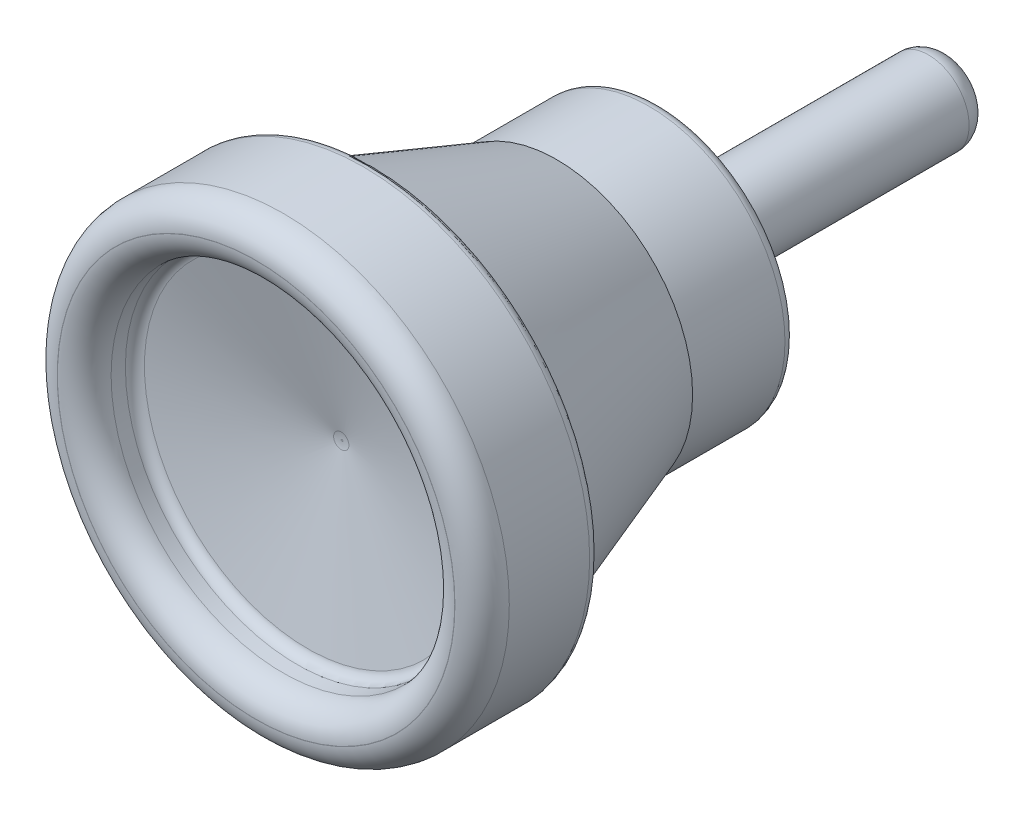
ISO-10303-21;
HEADER;
FILE_DESCRIPTION(('STEP AP214'),'2;1');
FILE_NAME('part.step','',(''),(''),'','','');
FILE_SCHEMA(('AUTOMOTIVE_DESIGN { 1 0 10303 214 1 1 1 1 }'));
ENDSEC;
DATA;
#1=APPLICATION_CONTEXT('core data for automotive mechanical design processes');
#2=APPLICATION_PROTOCOL_DEFINITION('international standard','automotive_design',2000,#1);
#3=PRODUCT_CONTEXT('',#1,'mechanical');
#4=PRODUCT('Part','Part','',(#3));
#5=PRODUCT_RELATED_PRODUCT_CATEGORY('part','',(#4));
#6=PRODUCT_DEFINITION_FORMATION('','',#4);
#7=PRODUCT_DEFINITION_CONTEXT('part definition',#1,'design');
#8=PRODUCT_DEFINITION('design','',#6,#7);
#9=PRODUCT_DEFINITION_SHAPE('','',#8);
#10=(LENGTH_UNIT() NAMED_UNIT(*) SI_UNIT(.MILLI.,.METRE.));
#11=(NAMED_UNIT(*) PLANE_ANGLE_UNIT() SI_UNIT($,.RADIAN.));
#12=(NAMED_UNIT(*) SI_UNIT($,.STERADIAN.) SOLID_ANGLE_UNIT());
#13=UNCERTAINTY_MEASURE_WITH_UNIT(LENGTH_MEASURE(1.E-05),#10,'distance_accuracy_value','');
#14=(GEOMETRIC_REPRESENTATION_CONTEXT(3) GLOBAL_UNCERTAINTY_ASSIGNED_CONTEXT((#13)) GLOBAL_UNIT_ASSIGNED_CONTEXT((#10,
#11,#12)) REPRESENTATION_CONTEXT('',''));
#15=CARTESIAN_POINT('',(0.,0.,0.));
#16=DIRECTION('',(0.,0.,1.));
#17=DIRECTION('',(1.,0.,0.));
#18=AXIS2_PLACEMENT_3D('',#15,#16,#17);
#19=CARTESIAN_POINT('',(0.,0.,-18.3));
#20=DIRECTION('',(0.,0.,1.));
#21=DIRECTION('',(1.,0.,0.));
#22=AXIS2_PLACEMENT_3D('',#19,#20,#21);
#23=TOROIDAL_SURFACE('',#22,5.825,0.5);
#24=CARTESIAN_POINT('',(0.,0.,-18.8));
#25=DIRECTION('',(0.,0.,1.));
#26=DIRECTION('',(1.,0.,0.));
#27=AXIS2_PLACEMENT_3D('',#24,#25,#26);
#28=CIRCLE('',#27,5.825);
#29=CARTESIAN_POINT('',(5.825,0.,-18.8));
#30=VERTEX_POINT('',#29);
#31=EDGE_CURVE('E86',#30,#30,#28,.T.);
#32=ORIENTED_EDGE('',*,*,#31,.T.);
#33=EDGE_LOOP('',(#32));
#34=FACE_BOUND('',#33,.T.);
#35=CARTESIAN_POINT('',(0.,0.,-18.3));
#36=DIRECTION('',(0.,0.,1.));
#37=DIRECTION('',(1.,0.,0.));
#38=AXIS2_PLACEMENT_3D('',#35,#36,#37);
#39=CIRCLE('',#38,6.325);
#40=CARTESIAN_POINT('',(6.325,0.,-18.3));
#41=VERTEX_POINT('',#40);
#42=EDGE_CURVE('E41',#41,#41,#39,.T.);
#43=ORIENTED_EDGE('',*,*,#42,.F.);
#44=EDGE_LOOP('',(#43));
#45=FACE_BOUND('',#44,.T.);
#46=ADVANCED_FACE('F30',(#34,#45),#23,.T.);
#47=CARTESIAN_POINT('',(0.,0.,-4.));
#48=DIRECTION('',(0.,0.,1.));
#49=DIRECTION('',(1.,0.,0.));
#50=AXIS2_PLACEMENT_3D('',#47,#48,#49);
#51=CYLINDRICAL_SURFACE('',#50,6.325);
#52=ORIENTED_EDGE('',*,*,#42,.T.);
#53=EDGE_LOOP('',(#52));
#54=FACE_BOUND('',#53,.T.);
#55=CARTESIAN_POINT('',(0.,0.,-14.));
#56=DIRECTION('',(0.,0.,1.));
#57=DIRECTION('',(1.,0.,0.));
#58=AXIS2_PLACEMENT_3D('',#55,#56,#57);
#59=CIRCLE('',#58,6.325);
#60=CARTESIAN_POINT('',(6.325,0.,-14.));
#61=VERTEX_POINT('',#60);
#62=EDGE_CURVE('E45',#61,#61,#59,.T.);
#63=ORIENTED_EDGE('',*,*,#62,.F.);
#64=EDGE_LOOP('',(#63));
#65=FACE_BOUND('',#64,.T.);
#66=ADVANCED_FACE('F104',(#54,#65),#51,.T.);
#67=CARTESIAN_POINT('',(0.,0.,-6.24797341657317));
#68=DIRECTION('',(0.,0.,1.));
#69=DIRECTION('',(1.,0.,0.));
#70=AXIS2_PLACEMENT_3D('',#67,#68,#69);
#71=CONICAL_SURFACE('',#70,9.07682280357459,0.341105400866473);
#72=ORIENTED_EDGE('',*,*,#62,.T.);
#73=EDGE_LOOP('',(#72));
#74=FACE_BOUND('',#73,.T.);
#75=CARTESIAN_POINT('',(0.,0.,-6.24797341657317));
#76=DIRECTION('',(0.,0.,1.));
#77=DIRECTION('',(1.,0.,0.));
#78=AXIS2_PLACEMENT_3D('',#75,#76,#77);
#79=CIRCLE('',#78,9.07682280357459);
#80=CARTESIAN_POINT('',(9.07682280357459,0.,-6.24797341657317));
#81=VERTEX_POINT('',#80);
#82=EDGE_CURVE('E50',#81,#81,#79,.T.);
#83=ORIENTED_EDGE('',*,*,#82,.F.);
#84=EDGE_LOOP('',(#83));
#85=FACE_BOUND('',#84,.T.);
#86=ADVANCED_FACE('F109',(#74,#85),#71,.T.);
#87=CARTESIAN_POINT('',(0.,0.,-6.41523792157666));
#88=DIRECTION('',(0.,0.,1.));
#89=DIRECTION('',(1.,0.,0.));
#90=AXIS2_PLACEMENT_3D('',#87,#88,#89);
#91=TOROIDAL_SURFACE('',#90,9.54801552992543,0.5);
#92=ORIENTED_EDGE('',*,*,#82,.T.);
#93=EDGE_LOOP('',(#92));
#94=FACE_BOUND('',#93,.T.);
#95=CARTESIAN_POINT('',(0.,0.,-5.97823372066855));
#96=DIRECTION('',(0.,0.,1.));
#97=DIRECTION('',(1.,0.,0.));
#98=AXIS2_PLACEMENT_3D('',#95,#96,#97);
#99=CIRCLE('',#98,9.30506012581046);
#100=CARTESIAN_POINT('',(9.30506012581046,0.,-5.97823372066855));
#101=VERTEX_POINT('',#100);
#102=EDGE_CURVE('E53',#101,#101,#99,.T.);
#103=ORIENTED_EDGE('',*,*,#102,.F.);
#104=EDGE_LOOP('',(#103));
#105=FACE_BOUND('',#104,.T.);
#106=ADVANCED_FACE('F115',(#94,#105),#91,.F.);
#107=CARTESIAN_POINT('',(0.,0.,-5.44290565980612));
#108=DIRECTION('',(0.,0.,1.));
#109=DIRECTION('',(1.,0.,0.));
#110=AXIS2_PLACEMENT_3D('',#107,#108,#109);
#111=CONICAL_SURFACE('',#110,10.267955404115,1.06339135597023);
#112=ORIENTED_EDGE('',*,*,#102,.T.);
#113=EDGE_LOOP('',(#112));
#114=FACE_BOUND('',#113,.T.);
#115=CARTESIAN_POINT('',(0.,0.,-5.44290565980612));
#116=DIRECTION('',(0.,0.,1.));
#117=DIRECTION('',(1.,0.,0.));
#118=AXIS2_PLACEMENT_3D('',#115,#116,#117);
#119=CIRCLE('',#118,10.267955404115);
#120=CARTESIAN_POINT('',(10.267955404115,0.,-5.44290565980612));
#121=VERTEX_POINT('',#120);
#122=EDGE_CURVE('E56',#121,#121,#119,.T.);
#123=ORIENTED_EDGE('',*,*,#122,.F.);
#124=EDGE_LOOP('',(#123));
#125=FACE_BOUND('',#124,.T.);
#126=ADVANCED_FACE('F121',(#114,#125),#111,.T.);
#127=CARTESIAN_POINT('',(0.,0.,-5.00590145889801));
#128=DIRECTION('',(0.,0.,1.));
#129=DIRECTION('',(1.,0.,0.));
#130=AXIS2_PLACEMENT_3D('',#127,#128,#129);
#131=TOROIDAL_SURFACE('',#130,10.025,0.5);
#132=ORIENTED_EDGE('',*,*,#122,.T.);
#133=EDGE_LOOP('',(#132));
#134=FACE_BOUND('',#133,.T.);
#135=CARTESIAN_POINT('',(0.,0.,-5.00590145889801));
#136=DIRECTION('',(0.,0.,1.));
#137=DIRECTION('',(1.,0.,0.));
#138=AXIS2_PLACEMENT_3D('',#135,#136,#137);
#139=CIRCLE('',#138,10.525);
#140=CARTESIAN_POINT('',(10.525,0.,-5.00590145889801));
#141=VERTEX_POINT('',#140);
#142=EDGE_CURVE('E59',#141,#141,#139,.T.);
#143=ORIENTED_EDGE('',*,*,#142,.F.);
#144=EDGE_LOOP('',(#143));
#145=FACE_BOUND('',#144,.T.);
#146=ADVANCED_FACE('F127',(#134,#145),#131,.T.);
#147=CARTESIAN_POINT('',(0.,0.,-4.));
#148=DIRECTION('',(0.,0.,1.));
#149=DIRECTION('',(1.,0.,0.));
#150=AXIS2_PLACEMENT_3D('',#147,#148,#149);
#151=CYLINDRICAL_SURFACE('',#150,10.525);
#152=ORIENTED_EDGE('',*,*,#142,.T.);
#153=EDGE_LOOP('',(#152));
#154=FACE_BOUND('',#153,.T.);
#155=CARTESIAN_POINT('',(0.,0.,-1.26500000000001));
#156=DIRECTION('',(0.,0.,1.));
#157=DIRECTION('',(1.,0.,0.));
#158=AXIS2_PLACEMENT_3D('',#155,#156,#157);
#159=CIRCLE('',#158,10.525);
#160=CARTESIAN_POINT('',(10.525,0.,-1.26500000000001));
#161=VERTEX_POINT('',#160);
#162=EDGE_CURVE('E62',#161,#161,#159,.T.);
#163=ORIENTED_EDGE('',*,*,#162,.F.);
#164=EDGE_LOOP('',(#163));
#165=FACE_BOUND('',#164,.T.);
#166=ADVANCED_FACE('F133',(#154,#165),#151,.T.);
#167=CARTESIAN_POINT('',(0.,0.,-1.265));
#168=DIRECTION('',(0.,0.,1.));
#169=DIRECTION('',(1.,0.,0.));
#170=AXIS2_PLACEMENT_3D('',#167,#168,#169);
#171=TOROIDAL_SURFACE('',#170,9.26,1.265);
#172=ORIENTED_EDGE('',*,*,#162,.T.);
#173=EDGE_LOOP('',(#172));
#174=FACE_BOUND('',#173,.T.);
#175=CARTESIAN_POINT('',(0.,0.,0.));
#176=DIRECTION('',(0.,0.,1.));
#177=DIRECTION('',(1.,0.,0.));
#178=AXIS2_PLACEMENT_3D('',#175,#176,#177);
#179=CIRCLE('',#178,9.25999999999999);
#180=CARTESIAN_POINT('',(9.25999999999999,0.,0.));
#181=VERTEX_POINT('',#180);
#182=EDGE_CURVE('E65',#181,#181,#179,.T.);
#183=ORIENTED_EDGE('',*,*,#182,.F.);
#184=EDGE_LOOP('',(#183));
#185=FACE_BOUND('',#184,.T.);
#186=ADVANCED_FACE('F139',(#174,#185),#171,.T.);
#187=CARTESIAN_POINT('',(9.25000000000001,0.,0.));
#188=DIRECTION('',(0.,0.,1.));
#189=DIRECTION('',(1.,0.,0.));
#190=AXIS2_PLACEMENT_3D('',#187,#188,#189);
#191=PLANE('',#190);
#192=ORIENTED_EDGE('',*,*,#182,.T.);
#193=EDGE_LOOP('',(#192));
#194=FACE_BOUND('',#193,.T.);
#195=CARTESIAN_POINT('',(0.,0.,0.));
#196=DIRECTION('',(0.,0.,1.));
#197=DIRECTION('',(1.,0.,0.));
#198=AXIS2_PLACEMENT_3D('',#195,#196,#197);
#199=CIRCLE('',#198,9.25);
#200=CARTESIAN_POINT('',(9.25,0.,0.));
#201=VERTEX_POINT('',#200);
#202=EDGE_CURVE('E68',#201,#201,#199,.T.);
#203=ORIENTED_EDGE('',*,*,#202,.F.);
#204=EDGE_LOOP('',(#203));
#205=FACE_BOUND('',#204,.T.);
#206=ADVANCED_FACE('F145',(#194,#205),#191,.T.);
#207=CARTESIAN_POINT('',(0.,0.,-1.25));
#208=DIRECTION('',(0.,0.,1.));
#209=DIRECTION('',(1.,0.,0.));
#210=AXIS2_PLACEMENT_3D('',#207,#208,#209);
#211=TOROIDAL_SURFACE('',#210,9.25,1.25);
#212=ORIENTED_EDGE('',*,*,#202,.T.);
#213=EDGE_LOOP('',(#212));
#214=FACE_BOUND('',#213,.T.);
#215=CARTESIAN_POINT('',(0.,0.,-1.25000000000001));
#216=DIRECTION('',(0.,0.,1.));
#217=DIRECTION('',(1.,0.,0.));
#218=AXIS2_PLACEMENT_3D('',#215,#216,#217);
#219=CIRCLE('',#218,8.);
#220=CARTESIAN_POINT('',(8.,0.,-1.25000000000001));
#221=VERTEX_POINT('',#220);
#222=EDGE_CURVE('E71',#221,#221,#219,.T.);
#223=ORIENTED_EDGE('',*,*,#222,.F.);
#224=EDGE_LOOP('',(#223));
#225=FACE_BOUND('',#224,.T.);
#226=ADVANCED_FACE('F151',(#214,#225),#211,.T.);
#227=CARTESIAN_POINT('',(0.,0.,-4.));
#228=DIRECTION('',(0.,0.,1.));
#229=DIRECTION('',(1.,0.,0.));
#230=AXIS2_PLACEMENT_3D('',#227,#228,#229);
#231=CYLINDRICAL_SURFACE('',#230,8.);
#232=ORIENTED_EDGE('',*,*,#222,.T.);
#233=EDGE_LOOP('',(#232));
#234=FACE_BOUND('',#233,.T.);
#235=CARTESIAN_POINT('',(0.,0.,-1.91409394209894));
#236=DIRECTION('',(0.,0.,1.));
#237=DIRECTION('',(1.,0.,0.));
#238=AXIS2_PLACEMENT_3D('',#235,#236,#237);
#239=CIRCLE('',#238,8.);
#240=CARTESIAN_POINT('',(8.,0.,-1.91409394209894));
#241=VERTEX_POINT('',#240);
#242=EDGE_CURVE('E74',#241,#241,#239,.T.);
#243=ORIENTED_EDGE('',*,*,#242,.F.);
#244=EDGE_LOOP('',(#243));
#245=FACE_BOUND('',#244,.T.);
#246=ADVANCED_FACE('F157',(#234,#245),#231,.F.);
#247=CARTESIAN_POINT('',(0.,0.,-1.91409394209894));
#248=DIRECTION('',(0.,0.,1.));
#249=DIRECTION('',(1.,0.,0.));
#250=AXIS2_PLACEMENT_3D('',#247,#248,#249);
#251=TOROIDAL_SURFACE('',#250,7.5,0.5);
#252=ORIENTED_EDGE('',*,*,#242,.T.);
#253=EDGE_LOOP('',(#252));
#254=FACE_BOUND('',#253,.T.);
#255=CARTESIAN_POINT('',(0.,0.,-2.40342069039993));
#256=DIRECTION('',(0.,0.,1.));
#257=DIRECTION('',(1.,0.,0.));
#258=AXIS2_PLACEMENT_3D('',#255,#256,#257);
#259=CIRCLE('',#258,7.6027586171432);
#260=CARTESIAN_POINT('',(7.6027586171432,0.,-2.40342069039993));
#261=VERTEX_POINT('',#260);
#262=EDGE_CURVE('E77',#261,#261,#259,.T.);
#263=ORIENTED_EDGE('',*,*,#262,.F.);
#264=EDGE_LOOP('',(#263));
#265=FACE_BOUND('',#264,.T.);
#266=ADVANCED_FACE('F163',(#254,#265),#251,.F.);
#267=CARTESIAN_POINT('',(0.,0.,-3.9662854081327));
#268=DIRECTION('',(0.,0.,1.));
#269=DIRECTION('',(1.,0.,0.));
#270=AXIS2_PLACEMENT_3D('',#267,#268,#269);
#271=CONICAL_SURFACE('',#270,0.356322322335259,1.35837645501249);
#272=ORIENTED_EDGE('',*,*,#262,.T.);
#273=EDGE_LOOP('',(#272));
#274=FACE_BOUND('',#273,.T.);
#275=CARTESIAN_POINT('',(0.,0.,-3.9662854081327));
#276=DIRECTION('',(0.,0.,1.));
#277=DIRECTION('',(1.,0.,0.));
#278=AXIS2_PLACEMENT_3D('',#275,#276,#277);
#279=CIRCLE('',#278,0.356322322335259);
#280=CARTESIAN_POINT('',(0.356322322335259,0.,-3.9662854081327));
#281=VERTEX_POINT('',#280);
#282=EDGE_CURVE('E80',#281,#281,#279,.T.);
#283=ORIENTED_EDGE('',*,*,#282,.F.);
#284=EDGE_LOOP('',(#283));
#285=FACE_BOUND('',#284,.T.);
#286=ADVANCED_FACE('F169',(#274,#285),#271,.F.);
#287=CARTESIAN_POINT('',(0.,0.,-2.5));
#288=DIRECTION('',(0.,0.,1.));
#289=DIRECTION('',(1.,0.,0.));
#290=AXIS2_PLACEMENT_3D('',#287,#288,#289);
#291=DEGENERATE_TOROIDAL_SURFACE('',#290,0.0400833274324869,1.5,.T.);
#292=ORIENTED_EDGE('',*,*,#282,.T.);
#293=EDGE_LOOP('',(#292));
#294=FACE_BOUND('',#293,.T.);
#295=CARTESIAN_POINT('',(0.,0.,-4.));
#296=DIRECTION('',(0.,0.,1.));
#297=DIRECTION('',(1.,0.,0.));
#298=AXIS2_PLACEMENT_3D('',#295,#296,#297);
#299=CIRCLE('',#298,0.0400833274324806);
#300=CARTESIAN_POINT('',(0.0400833274324806,0.,-4.));
#301=VERTEX_POINT('',#300);
#302=EDGE_CURVE('E83',#301,#301,#299,.T.);
#303=ORIENTED_EDGE('',*,*,#302,.F.);
#304=EDGE_LOOP('',(#303));
#305=FACE_BOUND('',#304,.T.);
#306=ADVANCED_FACE('F175',(#294,#305),#291,.F.);
#307=CARTESIAN_POINT('',(0.,0.,-4.));
#308=DIRECTION('',(0.,0.,1.));
#309=DIRECTION('',(1.,0.,0.));
#310=AXIS2_PLACEMENT_3D('',#307,#308,#309);
#311=PLANE('',#310);
#312=ORIENTED_EDGE('',*,*,#302,.T.);
#313=EDGE_LOOP('',(#312));
#314=FACE_BOUND('',#313,.T.);
#315=ADVANCED_FACE('F98',(#314),#311,.T.);
#316=CARTESIAN_POINT('',(0.,0.,-18.8));
#317=DIRECTION('',(0.,0.,-1.));
#318=DIRECTION('',(-1.,0.,0.));
#319=AXIS2_PLACEMENT_3D('',#316,#317,#318);
#320=PLANE('',#319);
#321=CARTESIAN_POINT('',(0.,0.,-18.8));
#322=DIRECTION('',(0.,0.,-1.));
#323=DIRECTION('',(-1.,0.,0.));
#324=AXIS2_PLACEMENT_3D('',#321,#322,#323);
#325=CIRCLE('',#324,1.9);
#326=CARTESIAN_POINT('',(-1.9,0.,-18.8));
#327=VERTEX_POINT('',#326);
#328=EDGE_CURVE('E89',#327,#327,#325,.T.);
#329=ORIENTED_EDGE('',*,*,#328,.F.);
#330=EDGE_LOOP('',(#329));
#331=FACE_BOUND('',#330,.T.);
#332=ORIENTED_EDGE('',*,*,#31,.F.);
#333=EDGE_LOOP('',(#332));
#334=FACE_BOUND('',#333,.T.);
#335=ADVANCED_FACE('F95',(#331,#334),#320,.T.);
#336=CARTESIAN_POINT('',(0.,0.,-32.3));
#337=DIRECTION('',(0.,0.,1.));
#338=DIRECTION('',(1.,0.,0.));
#339=AXIS2_PLACEMENT_3D('',#336,#337,#338);
#340=CYLINDRICAL_SURFACE('',#339,1.9);
#341=CARTESIAN_POINT('',(0.,0.,-31.3));
#342=DIRECTION('',(0.,0.,-1.));
#343=DIRECTION('',(-1.,0.,0.));
#344=AXIS2_PLACEMENT_3D('',#341,#342,#343);
#345=CIRCLE('',#344,1.9);
#346=CARTESIAN_POINT('',(-1.9,0.,-31.3));
#347=VERTEX_POINT('',#346);
#348=EDGE_CURVE('E10',#347,#347,#345,.F.);
#349=ORIENTED_EDGE('',*,*,#348,.T.);
#350=EDGE_LOOP('',(#349));
#351=FACE_BOUND('',#350,.T.);
#352=ORIENTED_EDGE('',*,*,#328,.T.);
#353=EDGE_LOOP('',(#352));
#354=FACE_BOUND('',#353,.T.);
#355=ADVANCED_FACE('F93',(#351,#354),#340,.T.);
#356=CARTESIAN_POINT('',(0.,0.,-32.3));
#357=DIRECTION('',(0.,0.,-1.));
#358=DIRECTION('',(-1.,0.,0.));
#359=AXIS2_PLACEMENT_3D('',#356,#357,#358);
#360=PLANE('',#359);
#361=CARTESIAN_POINT('',(0.,0.,-32.3));
#362=DIRECTION('',(0.,0.,-1.));
#363=DIRECTION('',(-1.,0.,0.));
#364=AXIS2_PLACEMENT_3D('',#361,#362,#363);
#365=CIRCLE('',#364,0.9);
#366=CARTESIAN_POINT('',(-0.9,0.,-32.3));
#367=VERTEX_POINT('',#366);
#368=EDGE_CURVE('E37',#367,#367,#365,.T.);
#369=ORIENTED_EDGE('',*,*,#368,.T.);
#370=EDGE_LOOP('',(#369));
#371=FACE_BOUND('',#370,.T.);
#372=ADVANCED_FACE('F191',(#371),#360,.T.);
#373=CARTESIAN_POINT('',(0.,0.,-31.3));
#374=DIRECTION('',(0.,0.,-1.));
#375=DIRECTION('',(-1.,0.,0.));
#376=AXIS2_PLACEMENT_3D('',#373,#374,#375);
#377=DEGENERATE_TOROIDAL_SURFACE('',#376,0.9,1.,.T.);
#378=ORIENTED_EDGE('',*,*,#348,.F.);
#379=EDGE_LOOP('',(#378));
#380=FACE_BOUND('',#379,.T.);
#381=ORIENTED_EDGE('',*,*,#368,.F.);
#382=EDGE_LOOP('',(#381));
#383=FACE_BOUND('',#382,.T.);
#384=ADVANCED_FACE('F32',(#380,#383),#377,.T.);
#385=CLOSED_SHELL('',(#46,#66,#86,#106,#126,#146,#166,#186,#206,#226,#246,#266,#286,#306,#315,
#335,#355,#372,#384));
#386=MANIFOLD_SOLID_BREP('B2',#385);
#387=ADVANCED_BREP_SHAPE_REPRESENTATION('',(#18,#386),#14);
#388=SHAPE_DEFINITION_REPRESENTATION(#9,#387);
ENDSEC;
END-ISO-10303-21;
